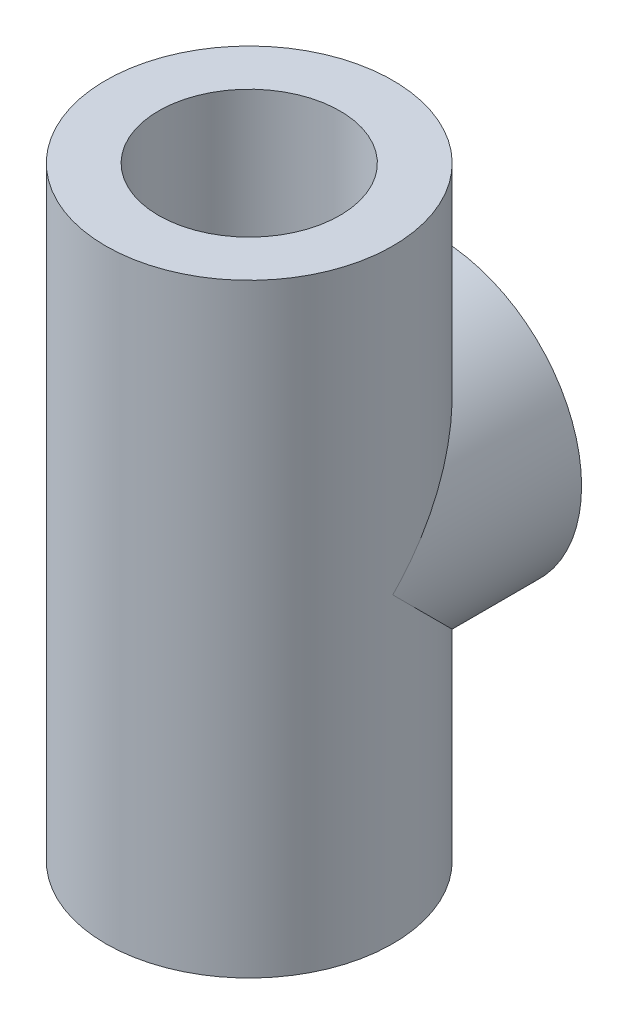
ISO-10303-21;
HEADER;
FILE_DESCRIPTION(('STEP AP214'),'2;1');
FILE_NAME('part.step','',(''),(''),'','','');
FILE_SCHEMA(('AUTOMOTIVE_DESIGN { 1 0 10303 214 1 1 1 1 }'));
ENDSEC;
DATA;
#1=APPLICATION_CONTEXT('core data for automotive mechanical design processes');
#2=APPLICATION_PROTOCOL_DEFINITION('international standard','automotive_design',2000,#1);
#3=PRODUCT_CONTEXT('',#1,'mechanical');
#4=PRODUCT('Part','Part','',(#3));
#5=PRODUCT_RELATED_PRODUCT_CATEGORY('part','',(#4));
#6=PRODUCT_DEFINITION_FORMATION('','',#4);
#7=PRODUCT_DEFINITION_CONTEXT('part definition',#1,'design');
#8=PRODUCT_DEFINITION('design','',#6,#7);
#9=PRODUCT_DEFINITION_SHAPE('','',#8);
#10=(LENGTH_UNIT() NAMED_UNIT(*) SI_UNIT(.MILLI.,.METRE.));
#11=(NAMED_UNIT(*) PLANE_ANGLE_UNIT() SI_UNIT($,.RADIAN.));
#12=(NAMED_UNIT(*) SI_UNIT($,.STERADIAN.) SOLID_ANGLE_UNIT());
#13=UNCERTAINTY_MEASURE_WITH_UNIT(LENGTH_MEASURE(1.E-05),#10,'distance_accuracy_value','');
#14=(GEOMETRIC_REPRESENTATION_CONTEXT(3) GLOBAL_UNCERTAINTY_ASSIGNED_CONTEXT((#13)) GLOBAL_UNIT_ASSIGNED_CONTEXT((#10,
#11,#12)) REPRESENTATION_CONTEXT('',''));
#15=CARTESIAN_POINT('',(0.,0.,0.));
#16=DIRECTION('',(0.,0.,1.));
#17=DIRECTION('',(1.,0.,0.));
#18=AXIS2_PLACEMENT_3D('',#15,#16,#17);
#19=CARTESIAN_POINT('',(0.,200.,0.));
#20=DIRECTION('',(0.,-1.,0.));
#21=DIRECTION('',(0.,0.,-1.));
#22=AXIS2_PLACEMENT_3D('',#19,#20,#21);
#23=CYLINDRICAL_SURFACE('',#22,47.5);
#24=CARTESIAN_POINT('',(0.,0.,0.));
#25=DIRECTION('',(0.,1.,0.));
#26=DIRECTION('',(0.,0.,1.));
#27=AXIS2_PLACEMENT_3D('',#24,#25,#26);
#28=CIRCLE('',#27,47.5);
#29=CARTESIAN_POINT('',(0.,0.,47.5));
#30=VERTEX_POINT('',#29);
#31=EDGE_CURVE('E51',#30,#30,#28,.T.);
#32=ORIENTED_EDGE('',*,*,#31,.T.);
#33=EDGE_LOOP('',(#32));
#34=FACE_BOUND('',#33,.T.);
#35=CARTESIAN_POINT('',(0.,200.,0.));
#36=DIRECTION('',(0.,1.,0.));
#37=DIRECTION('',(0.,0.,1.));
#38=AXIS2_PLACEMENT_3D('',#35,#36,#37);
#39=CIRCLE('',#38,47.5);
#40=CARTESIAN_POINT('',(0.,200.,47.5));
#41=VERTEX_POINT('',#40);
#42=EDGE_CURVE('E11',#41,#41,#39,.T.);
#43=ORIENTED_EDGE('',*,*,#42,.F.);
#44=EDGE_LOOP('',(#43));
#45=FACE_BOUND('',#44,.T.);
#46=CARTESIAN_POINT('',(0.,100.,0.));
#47=DIRECTION('',(0.,-0.707106781186547,-0.707106781186547));
#48=DIRECTION('',(0.,0.707106781186547,-0.707106781186547));
#49=AXIS2_PLACEMENT_3D('',#46,#47,#48);
#50=ELLIPSE('',#49,67.175144212722,47.5);
#51=CARTESIAN_POINT('',(47.5,100.,0.));
#52=VERTEX_POINT('',#51);
#53=CARTESIAN_POINT('',(-47.5,100.,0.));
#54=VERTEX_POINT('',#53);
#55=EDGE_CURVE('E60',#52,#54,#50,.F.);
#56=ORIENTED_EDGE('',*,*,#55,.T.);
#57=CARTESIAN_POINT('',(0.,100.,0.));
#58=DIRECTION('',(0.,0.707106781186547,-0.707106781186547));
#59=DIRECTION('',(0.,-0.707106781186547,-0.707106781186547));
#60=AXIS2_PLACEMENT_3D('',#57,#58,#59);
#61=ELLIPSE('',#60,67.175144212722,47.5);
#62=EDGE_CURVE('E58',#54,#52,#61,.F.);
#63=ORIENTED_EDGE('',*,*,#62,.T.);
#64=EDGE_LOOP('',(#56,#63));
#65=FACE_BOUND('',#64,.T.);
#66=ADVANCED_FACE('F43',(#34,#45,#65),#23,.T.);
#67=CARTESIAN_POINT('',(0.,200.,0.));
#68=DIRECTION('',(0.,1.,0.));
#69=DIRECTION('',(0.,0.,1.));
#70=AXIS2_PLACEMENT_3D('',#67,#68,#69);
#71=PLANE('',#70);
#72=ORIENTED_EDGE('',*,*,#42,.T.);
#73=EDGE_LOOP('',(#72));
#74=FACE_BOUND('',#73,.T.);
#75=CARTESIAN_POINT('',(0.,200.,0.));
#76=DIRECTION('',(0.,1.,0.));
#77=DIRECTION('',(0.,0.,1.));
#78=AXIS2_PLACEMENT_3D('',#75,#76,#77);
#79=CIRCLE('',#78,30.);
#80=CARTESIAN_POINT('',(0.,200.,30.));
#81=VERTEX_POINT('',#80);
#82=EDGE_CURVE('E68',#81,#81,#79,.T.);
#83=ORIENTED_EDGE('',*,*,#82,.F.);
#84=EDGE_LOOP('',(#83));
#85=FACE_BOUND('',#84,.T.);
#86=ADVANCED_FACE('F83',(#74,#85),#71,.T.);
#87=CARTESIAN_POINT('',(0.,0.,0.));
#88=DIRECTION('',(0.,1.,0.));
#89=DIRECTION('',(0.,0.,1.));
#90=AXIS2_PLACEMENT_3D('',#87,#88,#89);
#91=PLANE('',#90);
#92=ORIENTED_EDGE('',*,*,#31,.F.);
#93=EDGE_LOOP('',(#92));
#94=FACE_BOUND('',#93,.T.);
#95=CARTESIAN_POINT('',(0.,0.,0.));
#96=DIRECTION('',(0.,1.,0.));
#97=DIRECTION('',(0.,0.,1.));
#98=AXIS2_PLACEMENT_3D('',#95,#96,#97);
#99=CIRCLE('',#98,30.);
#100=CARTESIAN_POINT('',(0.,0.,30.));
#101=VERTEX_POINT('',#100);
#102=EDGE_CURVE('E65',#101,#101,#99,.T.);
#103=ORIENTED_EDGE('',*,*,#102,.T.);
#104=EDGE_LOOP('',(#103));
#105=FACE_BOUND('',#104,.T.);
#106=ADVANCED_FACE('F79',(#94,#105),#91,.F.);
#107=CARTESIAN_POINT('',(0.,200.,0.));
#108=DIRECTION('',(0.,-1.,0.));
#109=DIRECTION('',(0.,0.,-1.));
#110=AXIS2_PLACEMENT_3D('',#107,#108,#109);
#111=CYLINDRICAL_SURFACE('',#110,30.);
#112=ORIENTED_EDGE('',*,*,#82,.T.);
#113=EDGE_LOOP('',(#112));
#114=FACE_BOUND('',#113,.T.);
#115=ORIENTED_EDGE('',*,*,#102,.F.);
#116=EDGE_LOOP('',(#115));
#117=FACE_BOUND('',#116,.T.);
#118=ADVANCED_FACE('F82',(#114,#117),#111,.F.);
#119=CARTESIAN_POINT('',(0.,0.,-62.5));
#120=DIRECTION('',(0.,0.,1.));
#121=DIRECTION('',(1.,0.,0.));
#122=AXIS2_PLACEMENT_3D('',#119,#120,#121);
#123=PLANE('',#122);
#124=CARTESIAN_POINT('',(0.,138.,-62.5));
#125=DIRECTION('',(0.,0.,-1.));
#126=DIRECTION('',(-1.,0.,0.));
#127=AXIS2_PLACEMENT_3D('',#124,#125,#126);
#128=CIRCLE('',#127,5.);
#129=CARTESIAN_POINT('',(-5.,138.,-62.5));
#130=VERTEX_POINT('',#129);
#131=EDGE_CURVE('E267',#130,#130,#128,.T.);
#132=ORIENTED_EDGE('',*,*,#131,.F.);
#133=EDGE_LOOP('',(#132));
#134=FACE_BOUND('',#133,.T.);
#135=CARTESIAN_POINT('',(-38.,99.9999999999999,-62.5));
#136=DIRECTION('',(0.,0.,-1.));
#137=DIRECTION('',(-1.,0.,0.));
#138=AXIS2_PLACEMENT_3D('',#135,#136,#137);
#139=CIRCLE('',#138,5.);
#140=CARTESIAN_POINT('',(-43.,99.9999999999999,-62.5));
#141=VERTEX_POINT('',#140);
#142=EDGE_CURVE('E271',#141,#141,#139,.T.);
#143=ORIENTED_EDGE('',*,*,#142,.F.);
#144=EDGE_LOOP('',(#143));
#145=FACE_BOUND('',#144,.T.);
#146=CARTESIAN_POINT('',(2.65352581752078E-13,62.,-62.5));
#147=DIRECTION('',(0.,0.,-1.));
#148=DIRECTION('',(-1.,0.,0.));
#149=AXIS2_PLACEMENT_3D('',#146,#147,#148);
#150=CIRCLE('',#149,5.);
#151=CARTESIAN_POINT('',(-4.99999999999974,62.,-62.5));
#152=VERTEX_POINT('',#151);
#153=EDGE_CURVE('E279',#152,#152,#150,.T.);
#154=ORIENTED_EDGE('',*,*,#153,.F.);
#155=EDGE_LOOP('',(#154));
#156=FACE_BOUND('',#155,.T.);
#157=CARTESIAN_POINT('',(38.,100.,-62.5));
#158=DIRECTION('',(0.,0.,-1.));
#159=DIRECTION('',(-1.,0.,0.));
#160=AXIS2_PLACEMENT_3D('',#157,#158,#159);
#161=CIRCLE('',#160,5.);
#162=CARTESIAN_POINT('',(33.,100.,-62.5));
#163=VERTEX_POINT('',#162);
#164=EDGE_CURVE('E285',#163,#163,#161,.T.);
#165=ORIENTED_EDGE('',*,*,#164,.F.);
#166=EDGE_LOOP('',(#165));
#167=FACE_BOUND('',#166,.T.);
#168=CARTESIAN_POINT('',(0.,100.,-62.5));
#169=DIRECTION('',(0.,0.,1.));
#170=DIRECTION('',(1.,0.,0.));
#171=AXIS2_PLACEMENT_3D('',#168,#169,#170);
#172=CIRCLE('',#171,27.);
#173=CARTESIAN_POINT('',(27.,100.,-62.5));
#174=VERTEX_POINT('',#173);
#175=EDGE_CURVE('E46',#174,#174,#172,.F.);
#176=ORIENTED_EDGE('',*,*,#175,.F.);
#177=EDGE_LOOP('',(#176));
#178=FACE_BOUND('',#177,.T.);
#179=CARTESIAN_POINT('',(0.,100.,-62.5));
#180=DIRECTION('',(0.,0.,1.));
#181=DIRECTION('',(1.,0.,0.));
#182=AXIS2_PLACEMENT_3D('',#179,#180,#181);
#183=CIRCLE('',#182,47.5);
#184=CARTESIAN_POINT('',(47.5,100.,-62.5));
#185=VERTEX_POINT('',#184);
#186=EDGE_CURVE('E62',#185,#185,#183,.T.);
#187=ORIENTED_EDGE('',*,*,#186,.F.);
#188=EDGE_LOOP('',(#187));
#189=FACE_BOUND('',#188,.T.);
#190=ADVANCED_FACE('F87',(#134,#145,#156,#167,#178,#189),#123,.F.);
#191=CARTESIAN_POINT('',(0.,100.,47.502));
#192=DIRECTION('',(0.,0.,-1.));
#193=DIRECTION('',(-1.,0.,0.));
#194=AXIS2_PLACEMENT_3D('',#191,#192,#193);
#195=CYLINDRICAL_SURFACE('',#194,47.5);
#196=ORIENTED_EDGE('',*,*,#186,.T.);
#197=EDGE_LOOP('',(#196));
#198=FACE_BOUND('',#197,.T.);
#199=ORIENTED_EDGE('',*,*,#55,.F.);
#200=ORIENTED_EDGE('',*,*,#62,.F.);
#201=EDGE_LOOP('',(#199,#200));
#202=FACE_BOUND('',#201,.T.);
#203=ADVANCED_FACE('F64',(#198,#202),#195,.T.);
#204=CARTESIAN_POINT('',(0.,100.,-62.500012));
#205=DIRECTION('',(0.,0.,1.));
#206=DIRECTION('',(1.,0.,0.));
#207=AXIS2_PLACEMENT_3D('',#204,#205,#206);
#208=CYLINDRICAL_SURFACE('',#207,27.);
#209=CARTESIAN_POINT('',(0.,100.,-58.5));
#210=DIRECTION('',(0.,0.,-1.));
#211=DIRECTION('',(-1.,0.,0.));
#212=AXIS2_PLACEMENT_3D('',#209,#210,#211);
#213=CIRCLE('',#212,27.);
#214=CARTESIAN_POINT('',(-27.,100.,-58.5));
#215=VERTEX_POINT('',#214);
#216=EDGE_CURVE('E266',#215,#215,#213,.T.);
#217=ORIENTED_EDGE('',*,*,#216,.F.);
#218=EDGE_LOOP('',(#217));
#219=FACE_BOUND('',#218,.T.);
#220=ORIENTED_EDGE('',*,*,#175,.T.);
#221=EDGE_LOOP('',(#220));
#222=FACE_BOUND('',#221,.T.);
#223=ADVANCED_FACE('F131',(#219,#222),#208,.F.);
#224=CARTESIAN_POINT('',(0.,100.,-58.5));
#225=DIRECTION('',(0.,0.,-1.));
#226=DIRECTION('',(-1.,0.,0.));
#227=AXIS2_PLACEMENT_3D('',#224,#225,#226);
#228=PLANE('',#227);
#229=ORIENTED_EDGE('',*,*,#216,.T.);
#230=EDGE_LOOP('',(#229));
#231=FACE_BOUND('',#230,.T.);
#232=ADVANCED_FACE('F142',(#231),#228,.T.);
#233=CARTESIAN_POINT('',(38.,100.,-42.5));
#234=DIRECTION('',(0.,0.,-1.));
#235=DIRECTION('',(-1.,0.,0.));
#236=AXIS2_PLACEMENT_3D('',#233,#234,#235);
#237=CYLINDRICAL_SURFACE('',#236,5.);
#238=CARTESIAN_POINT('',(38.,100.,-42.5));
#239=DIRECTION('',(0.,0.,-1.));
#240=DIRECTION('',(-1.,0.,0.));
#241=AXIS2_PLACEMENT_3D('',#238,#239,#240);
#242=CIRCLE('',#241,5.);
#243=CARTESIAN_POINT('',(33.,100.,-42.5));
#244=VERTEX_POINT('',#243);
#245=EDGE_CURVE('E288',#244,#244,#242,.T.);
#246=ORIENTED_EDGE('',*,*,#245,.F.);
#247=EDGE_LOOP('',(#246));
#248=FACE_BOUND('',#247,.T.);
#249=ORIENTED_EDGE('',*,*,#164,.T.);
#250=EDGE_LOOP('',(#249));
#251=FACE_BOUND('',#250,.T.);
#252=ADVANCED_FACE('F153',(#248,#251),#237,.F.);
#253=CARTESIAN_POINT('',(38.,100.,-42.5));
#254=DIRECTION('',(0.,0.,-1.));
#255=DIRECTION('',(-1.,0.,0.));
#256=AXIS2_PLACEMENT_3D('',#253,#254,#255);
#257=PLANE('',#256);
#258=ORIENTED_EDGE('',*,*,#245,.T.);
#259=EDGE_LOOP('',(#258));
#260=FACE_BOUND('',#259,.T.);
#261=ADVANCED_FACE('F169',(#260),#257,.T.);
#262=CARTESIAN_POINT('',(2.65352581752078E-13,62.,-42.5));
#263=DIRECTION('',(0.,0.,-1.));
#264=DIRECTION('',(-1.,0.,0.));
#265=AXIS2_PLACEMENT_3D('',#262,#263,#264);
#266=CYLINDRICAL_SURFACE('',#265,5.);
#267=CARTESIAN_POINT('',(2.65352581752078E-13,62.,-42.5));
#268=DIRECTION('',(0.,0.,-1.));
#269=DIRECTION('',(-1.,0.,0.));
#270=AXIS2_PLACEMENT_3D('',#267,#268,#269);
#271=CIRCLE('',#270,5.);
#272=CARTESIAN_POINT('',(-4.99999999999974,62.,-42.5));
#273=VERTEX_POINT('',#272);
#274=EDGE_CURVE('E282',#273,#273,#271,.T.);
#275=ORIENTED_EDGE('',*,*,#274,.F.);
#276=EDGE_LOOP('',(#275));
#277=FACE_BOUND('',#276,.T.);
#278=ORIENTED_EDGE('',*,*,#153,.T.);
#279=EDGE_LOOP('',(#278));
#280=FACE_BOUND('',#279,.T.);
#281=ADVANCED_FACE('F180',(#277,#280),#266,.F.);
#282=CARTESIAN_POINT('',(2.65352581752078E-13,62.,-42.5));
#283=DIRECTION('',(0.,0.,-1.));
#284=DIRECTION('',(-1.,0.,0.));
#285=AXIS2_PLACEMENT_3D('',#282,#283,#284);
#286=PLANE('',#285);
#287=ORIENTED_EDGE('',*,*,#274,.T.);
#288=EDGE_LOOP('',(#287));
#289=FACE_BOUND('',#288,.T.);
#290=ADVANCED_FACE('F191',(#289),#286,.T.);
#291=CARTESIAN_POINT('',(-38.,99.9999999999999,-42.5));
#292=DIRECTION('',(0.,0.,-1.));
#293=DIRECTION('',(-1.,0.,0.));
#294=AXIS2_PLACEMENT_3D('',#291,#292,#293);
#295=CYLINDRICAL_SURFACE('',#294,5.);
#296=CARTESIAN_POINT('',(-38.,99.9999999999999,-42.5));
#297=DIRECTION('',(0.,0.,-1.));
#298=DIRECTION('',(-1.,0.,0.));
#299=AXIS2_PLACEMENT_3D('',#296,#297,#298);
#300=CIRCLE('',#299,5.);
#301=CARTESIAN_POINT('',(-43.,99.9999999999999,-42.5));
#302=VERTEX_POINT('',#301);
#303=EDGE_CURVE('E276',#302,#302,#300,.T.);
#304=ORIENTED_EDGE('',*,*,#303,.F.);
#305=EDGE_LOOP('',(#304));
#306=FACE_BOUND('',#305,.T.);
#307=ORIENTED_EDGE('',*,*,#142,.T.);
#308=EDGE_LOOP('',(#307));
#309=FACE_BOUND('',#308,.T.);
#310=ADVANCED_FACE('F202',(#306,#309),#295,.F.);
#311=CARTESIAN_POINT('',(-38.,99.9999999999999,-42.5));
#312=DIRECTION('',(0.,0.,-1.));
#313=DIRECTION('',(-1.,0.,0.));
#314=AXIS2_PLACEMENT_3D('',#311,#312,#313);
#315=PLANE('',#314);
#316=ORIENTED_EDGE('',*,*,#303,.T.);
#317=EDGE_LOOP('',(#316));
#318=FACE_BOUND('',#317,.T.);
#319=ADVANCED_FACE('F213',(#318),#315,.T.);
#320=CARTESIAN_POINT('',(0.,138.,-42.5));
#321=DIRECTION('',(0.,0.,-1.));
#322=DIRECTION('',(-1.,0.,0.));
#323=AXIS2_PLACEMENT_3D('',#320,#321,#322);
#324=CYLINDRICAL_SURFACE('',#323,5.);
#325=CARTESIAN_POINT('',(0.,138.,-42.5));
#326=DIRECTION('',(0.,0.,-1.));
#327=DIRECTION('',(-1.,0.,0.));
#328=AXIS2_PLACEMENT_3D('',#325,#326,#327);
#329=CIRCLE('',#328,5.);
#330=CARTESIAN_POINT('',(-5.,138.,-42.5));
#331=VERTEX_POINT('',#330);
#332=EDGE_CURVE('E265',#331,#331,#329,.T.);
#333=ORIENTED_EDGE('',*,*,#332,.F.);
#334=EDGE_LOOP('',(#333));
#335=FACE_BOUND('',#334,.T.);
#336=ORIENTED_EDGE('',*,*,#131,.T.);
#337=EDGE_LOOP('',(#336));
#338=FACE_BOUND('',#337,.T.);
#339=ADVANCED_FACE('F224',(#335,#338),#324,.F.);
#340=CARTESIAN_POINT('',(0.,138.,-42.5));
#341=DIRECTION('',(0.,0.,-1.));
#342=DIRECTION('',(-1.,0.,0.));
#343=AXIS2_PLACEMENT_3D('',#340,#341,#342);
#344=PLANE('',#343);
#345=ORIENTED_EDGE('',*,*,#332,.T.);
#346=EDGE_LOOP('',(#345));
#347=FACE_BOUND('',#346,.T.);
#348=ADVANCED_FACE('F235',(#347),#344,.T.);
#349=CLOSED_SHELL('',(#66,#86,#106,#118,#190,#203,#223,#232,#252,#261,#281,#290,#310,#319,#339,#348));
#350=MANIFOLD_SOLID_BREP('B2',#349);
#351=ADVANCED_BREP_SHAPE_REPRESENTATION('',(#18,#350),#14);
#352=SHAPE_DEFINITION_REPRESENTATION(#9,#351);
ENDSEC;
END-ISO-10303-21;
